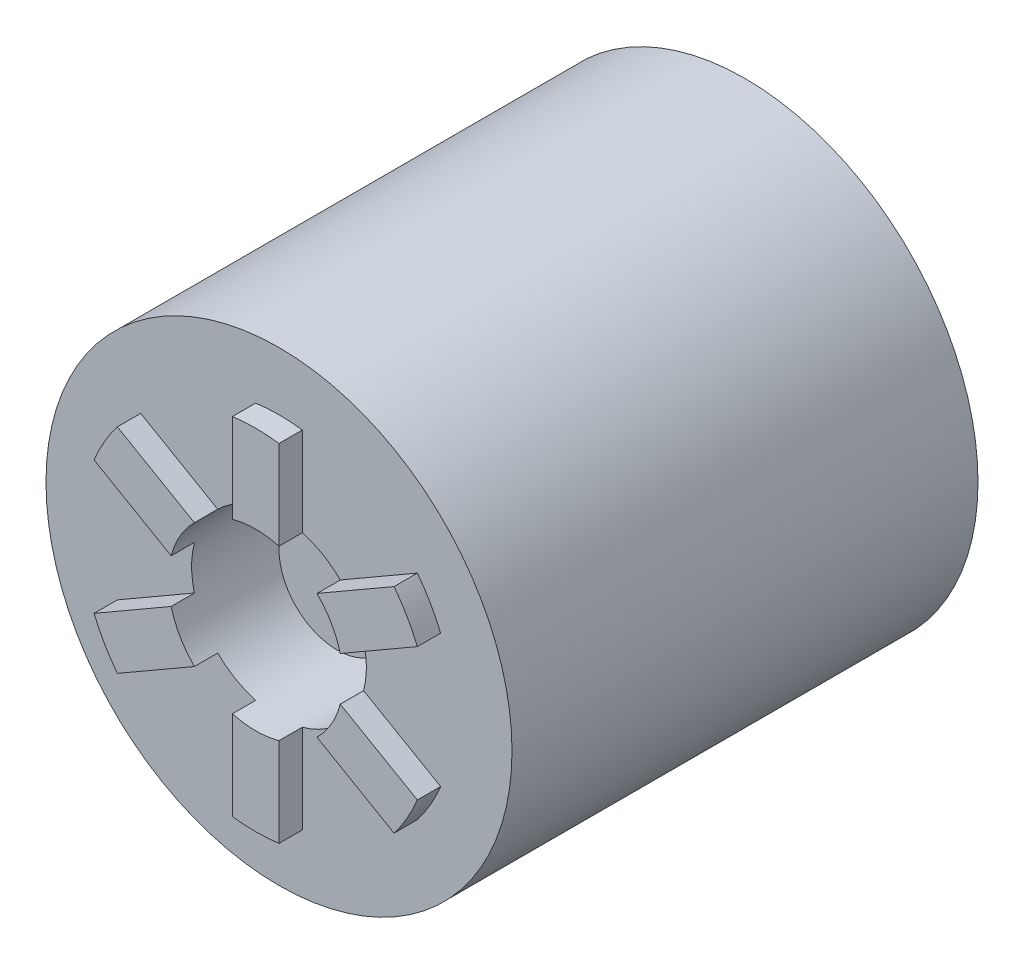
ISO-10303-21;
HEADER;
FILE_DESCRIPTION(('STEP AP214'),'2;1');
FILE_NAME('part.step','',(''),(''),'','','');
FILE_SCHEMA(('AUTOMOTIVE_DESIGN { 1 0 10303 214 1 1 1 1 }'));
ENDSEC;
DATA;
#1=APPLICATION_CONTEXT('core data for automotive mechanical design processes');
#2=APPLICATION_PROTOCOL_DEFINITION('international standard','automotive_design',2000,#1);
#3=PRODUCT_CONTEXT('',#1,'mechanical');
#4=PRODUCT('Part','Part','',(#3));
#5=PRODUCT_RELATED_PRODUCT_CATEGORY('part','',(#4));
#6=PRODUCT_DEFINITION_FORMATION('','',#4);
#7=PRODUCT_DEFINITION_CONTEXT('part definition',#1,'design');
#8=PRODUCT_DEFINITION('design','',#6,#7);
#9=PRODUCT_DEFINITION_SHAPE('','',#8);
#10=(LENGTH_UNIT() NAMED_UNIT(*) SI_UNIT(.MILLI.,.METRE.));
#11=(NAMED_UNIT(*) PLANE_ANGLE_UNIT() SI_UNIT($,.RADIAN.));
#12=(NAMED_UNIT(*) SI_UNIT($,.STERADIAN.) SOLID_ANGLE_UNIT());
#13=UNCERTAINTY_MEASURE_WITH_UNIT(LENGTH_MEASURE(1.E-05),#10,'distance_accuracy_value','');
#14=(GEOMETRIC_REPRESENTATION_CONTEXT(3) GLOBAL_UNCERTAINTY_ASSIGNED_CONTEXT((#13)) GLOBAL_UNIT_ASSIGNED_CONTEXT((#10,
#11,#12)) REPRESENTATION_CONTEXT('',''));
#15=CARTESIAN_POINT('',(0.,0.,0.));
#16=DIRECTION('',(0.,0.,1.));
#17=DIRECTION('',(1.,0.,0.));
#18=AXIS2_PLACEMENT_3D('',#15,#16,#17);
#19=CARTESIAN_POINT('',(0.,0.,40.));
#20=DIRECTION('',(0.,0.,1.));
#21=DIRECTION('',(1.,0.,0.));
#22=AXIS2_PLACEMENT_3D('',#19,#20,#21);
#23=PLANE('',#22);
#24=CARTESIAN_POINT('',(0.,0.,40.));
#25=DIRECTION('',(0.,0.,1.));
#26=DIRECTION('',(1.,0.,0.));
#27=AXIS2_PLACEMENT_3D('',#24,#25,#26);
#28=CIRCLE('',#27,20.);
#29=CARTESIAN_POINT('',(20.,0.,40.));
#30=VERTEX_POINT('',#29);
#31=EDGE_CURVE('E12',#30,#30,#28,.T.);
#32=ORIENTED_EDGE('',*,*,#31,.T.);
#33=EDGE_LOOP('',(#32));
#34=FACE_BOUND('',#33,.T.);
#35=CARTESIAN_POINT('',(0.,0.,40.));
#36=DIRECTION('',(0.,0.,1.));
#37=DIRECTION('',(1.,0.,0.));
#38=AXIS2_PLACEMENT_3D('',#35,#36,#37);
#39=CIRCLE('',#38,15.);
#40=CARTESIAN_POINT('',(-11.8743931895834,9.16508518122775,40.));
#41=VERTEX_POINT('',#40);
#42=CARTESIAN_POINT('',(-13.8743931895834,5.70098356608999,40.));
#43=VERTEX_POINT('',#42);
#44=EDGE_CURVE('E629',#41,#43,#39,.T.);
#45=ORIENTED_EDGE('',*,*,#44,.F.);
#46=DIRECTION('',(-0.866025403784439,0.499999999999999,0.));
#47=VECTOR('',#46,1.);
#48=CARTESIAN_POINT('',(0.99999999999993,1.73205080756876,40.));
#49=LINE('',#48,#47);
#50=CARTESIAN_POINT('',(-5.25999201277456,5.34625888126901,40.));
#51=VERTEX_POINT('',#50);
#52=EDGE_CURVE('E243',#51,#41,#49,.T.);
#53=ORIENTED_EDGE('',*,*,#52,.F.);
#54=CARTESIAN_POINT('',(0.,0.,40.));
#55=DIRECTION('',(0.,0.,1.));
#56=DIRECTION('',(1.,0.,0.));
#57=AXIS2_PLACEMENT_3D('',#54,#55,#56);
#58=CIRCLE('',#57,7.5);
#59=CARTESIAN_POINT('',(-2.,7.22841614740048,40.));
#60=VERTEX_POINT('',#59);
#61=EDGE_CURVE('E455',#60,#51,#58,.T.);
#62=ORIENTED_EDGE('',*,*,#61,.F.);
#63=DIRECTION('',(0.,1.,0.));
#64=VECTOR('',#63,1.);
#65=CARTESIAN_POINT('',(-2.,0.,40.));
#66=LINE('',#65,#64);
#67=CARTESIAN_POINT('',(-2.,14.8660687473185,40.));
#68=VERTEX_POINT('',#67);
#69=EDGE_CURVE('E415',#60,#68,#66,.T.);
#70=ORIENTED_EDGE('',*,*,#69,.T.);
#71=CARTESIAN_POINT('',(0.,0.,40.));
#72=DIRECTION('',(0.,0.,1.));
#73=DIRECTION('',(1.,0.,0.));
#74=AXIS2_PLACEMENT_3D('',#71,#72,#73);
#75=CIRCLE('',#74,15.);
#76=CARTESIAN_POINT('',(2.,14.8660687473185,40.));
#77=VERTEX_POINT('',#76);
#78=EDGE_CURVE('E429',#77,#68,#75,.T.);
#79=ORIENTED_EDGE('',*,*,#78,.F.);
#80=DIRECTION('',(0.,1.,0.));
#81=VECTOR('',#80,1.);
#82=CARTESIAN_POINT('',(2.,0.,40.));
#83=LINE('',#82,#81);
#84=CARTESIAN_POINT('',(2.,7.22841614740048,40.));
#85=VERTEX_POINT('',#84);
#86=EDGE_CURVE('E409',#85,#77,#83,.T.);
#87=ORIENTED_EDGE('',*,*,#86,.F.);
#88=CARTESIAN_POINT('',(5.25999201277418,5.34625888126939,40.));
#89=VERTEX_POINT('',#88);
#90=EDGE_CURVE('E450',#89,#85,#58,.T.);
#91=ORIENTED_EDGE('',*,*,#90,.F.);
#92=DIRECTION('',(0.866025403784439,0.5,0.));
#93=VECTOR('',#92,1.);
#94=CARTESIAN_POINT('',(-1.00000000000019,1.7320508075692,40.));
#95=LINE('',#94,#93);
#96=CARTESIAN_POINT('',(11.8743931895839,9.16508518122864,40.));
#97=VERTEX_POINT('',#96);
#98=EDGE_CURVE('E375',#89,#97,#95,.T.);
#99=ORIENTED_EDGE('',*,*,#98,.T.);
#100=CARTESIAN_POINT('',(0.,0.,40.));
#101=DIRECTION('',(0.,0.,1.));
#102=DIRECTION('',(1.,0.,0.));
#103=AXIS2_PLACEMENT_3D('',#100,#101,#102);
#104=CIRCLE('',#103,15.);
#105=CARTESIAN_POINT('',(13.8743931895839,5.70098356609089,40.));
#106=VERTEX_POINT('',#105);
#107=EDGE_CURVE('E389',#106,#97,#104,.T.);
#108=ORIENTED_EDGE('',*,*,#107,.F.);
#109=DIRECTION('',(0.866025403784439,0.5,0.));
#110=VECTOR('',#109,1.);
#111=CARTESIAN_POINT('',(0.999999999999812,-1.73205080756855,40.));
#112=LINE('',#111,#110);
#113=CARTESIAN_POINT('',(7.25999201277436,1.88215726613174,40.));
#114=VERTEX_POINT('',#113);
#115=EDGE_CURVE('E369',#114,#106,#112,.T.);
#116=ORIENTED_EDGE('',*,*,#115,.F.);
#117=CARTESIAN_POINT('',(7.25999201277469,-1.88215726613047,40.));
#118=VERTEX_POINT('',#117);
#119=EDGE_CURVE('E648',#118,#114,#58,.T.);
#120=ORIENTED_EDGE('',*,*,#119,.F.);
#121=DIRECTION('',(0.866025403784439,-0.5,0.));
#122=VECTOR('',#121,1.);
#123=CARTESIAN_POINT('',(1.00000000000044,1.73205080756965,40.));
#124=LINE('',#123,#122);
#125=CARTESIAN_POINT('',(13.8743931895844,-5.70098356608972,40.));
#126=VERTEX_POINT('',#125);
#127=EDGE_CURVE('E335',#118,#126,#124,.T.);
#128=ORIENTED_EDGE('',*,*,#127,.T.);
#129=CARTESIAN_POINT('',(0.,0.,40.));
#130=DIRECTION('',(0.,0.,1.));
#131=DIRECTION('',(1.,0.,0.));
#132=AXIS2_PLACEMENT_3D('',#129,#130,#131);
#133=CIRCLE('',#132,15.);
#134=CARTESIAN_POINT('',(11.8743931895844,-9.16508518122748,40.));
#135=VERTEX_POINT('',#134);
#136=EDGE_CURVE('E349',#135,#126,#133,.T.);
#137=ORIENTED_EDGE('',*,*,#136,.F.);
#138=DIRECTION('',(0.866025403784439,-0.5,0.));
#139=VECTOR('',#138,1.);
#140=CARTESIAN_POINT('',(-0.999999999999556,-1.73205080756811,40.));
#141=LINE('',#140,#139);
#142=CARTESIAN_POINT('',(5.25999201277511,-5.34625888126847,40.));
#143=VERTEX_POINT('',#142);
#144=EDGE_CURVE('E329',#143,#135,#141,.T.);
#145=ORIENTED_EDGE('',*,*,#144,.F.);
#146=CARTESIAN_POINT('',(2.00000000000103,-7.2284161474002,40.));
#147=VERTEX_POINT('',#146);
#148=EDGE_CURVE('E644',#147,#143,#58,.T.);
#149=ORIENTED_EDGE('',*,*,#148,.F.);
#150=DIRECTION('',(0.,-1.,0.));
#151=VECTOR('',#150,1.);
#152=CARTESIAN_POINT('',(2.00000000000103,0.,40.));
#153=LINE('',#152,#151);
#154=CARTESIAN_POINT('',(2.00000000000103,-14.8660687473182,40.));
#155=VERTEX_POINT('',#154);
#156=EDGE_CURVE('E295',#147,#155,#153,.T.);
#157=ORIENTED_EDGE('',*,*,#156,.T.);
#158=CARTESIAN_POINT('',(0.,0.,40.));
#159=DIRECTION('',(0.,0.,1.));
#160=DIRECTION('',(1.,0.,0.));
#161=AXIS2_PLACEMENT_3D('',#158,#159,#160);
#162=CIRCLE('',#161,15.);
#163=CARTESIAN_POINT('',(-1.99999999999897,-14.8660687473182,40.));
#164=VERTEX_POINT('',#163);
#165=EDGE_CURVE('E309',#164,#155,#162,.T.);
#166=ORIENTED_EDGE('',*,*,#165,.F.);
#167=DIRECTION('',(0.,-1.,0.));
#168=VECTOR('',#167,1.);
#169=CARTESIAN_POINT('',(-1.99999999999897,0.,40.));
#170=LINE('',#169,#168);
#171=CARTESIAN_POINT('',(-1.99999999999897,-7.22841614740076,40.));
#172=VERTEX_POINT('',#171);
#173=EDGE_CURVE('E289',#172,#164,#170,.T.);
#174=ORIENTED_EDGE('',*,*,#173,.F.);
#175=CARTESIAN_POINT('',(-5.25999201277397,-5.34625888126959,40.));
#176=VERTEX_POINT('',#175);
#177=EDGE_CURVE('E642',#176,#172,#58,.T.);
#178=ORIENTED_EDGE('',*,*,#177,.F.);
#179=DIRECTION('',(-0.866025403784438,-0.5,0.));
#180=VECTOR('',#179,1.);
#181=CARTESIAN_POINT('',(1.00000000000033,-1.73205080756944,40.));
#182=LINE('',#181,#180);
#183=CARTESIAN_POINT('',(-11.8743931895828,-9.16508518122837,40.));
#184=VERTEX_POINT('',#183);
#185=EDGE_CURVE('E81',#176,#184,#182,.T.);
#186=ORIENTED_EDGE('',*,*,#185,.T.);
#187=CARTESIAN_POINT('',(0.,0.,40.));
#188=DIRECTION('',(0.,0.,1.));
#189=DIRECTION('',(1.,0.,0.));
#190=AXIS2_PLACEMENT_3D('',#187,#188,#189);
#191=CIRCLE('',#190,15.);
#192=CARTESIAN_POINT('',(-13.8743931895828,-5.70098356609062,40.));
#193=VERTEX_POINT('',#192);
#194=EDGE_CURVE('E251',#193,#184,#191,.T.);
#195=ORIENTED_EDGE('',*,*,#194,.F.);
#196=DIRECTION('',(-0.866025403784438,-0.5,0.));
#197=VECTOR('',#196,1.);
#198=CARTESIAN_POINT('',(-0.999999999999676,1.73205080756831,40.));
#199=LINE('',#198,#197);
#200=CARTESIAN_POINT('',(-7.25999201277429,-1.88215726613202,40.));
#201=VERTEX_POINT('',#200);
#202=EDGE_CURVE('E246',#201,#193,#199,.T.);
#203=ORIENTED_EDGE('',*,*,#202,.F.);
#204=CARTESIAN_POINT('',(-7.25999201277449,1.88215726613122,40.));
#205=VERTEX_POINT('',#204);
#206=EDGE_CURVE('E458',#205,#201,#58,.T.);
#207=ORIENTED_EDGE('',*,*,#206,.F.);
#208=DIRECTION('',(-0.866025403784439,0.499999999999999,0.));
#209=VECTOR('',#208,1.);
#210=CARTESIAN_POINT('',(-1.00000000000007,-1.732050807569,40.));
#211=LINE('',#210,#209);
#212=EDGE_CURVE('E73',#205,#43,#211,.T.);
#213=ORIENTED_EDGE('',*,*,#212,.T.);
#214=EDGE_LOOP('',(#45,#53,#62,#70,#79,#87,#91,#99,#108,#116,#120,#128,#137,#145,#149,#157,#166,
#174,#178,#186,#195,#203,#207,#213));
#215=FACE_BOUND('',#214,.T.);
#216=ADVANCED_FACE('F55',(#34,#215),#23,.T.);
#217=CARTESIAN_POINT('',(0.,0.,40.));
#218=DIRECTION('',(0.,0.,-1.));
#219=DIRECTION('',(-1.,0.,0.));
#220=AXIS2_PLACEMENT_3D('',#217,#218,#219);
#221=CYLINDRICAL_SURFACE('',#220,20.);
#222=ORIENTED_EDGE('',*,*,#31,.F.);
#223=EDGE_LOOP('',(#222));
#224=FACE_BOUND('',#223,.T.);
#225=CARTESIAN_POINT('',(0.,0.,0.));
#226=DIRECTION('',(0.,0.,1.));
#227=DIRECTION('',(1.,0.,0.));
#228=AXIS2_PLACEMENT_3D('',#225,#226,#227);
#229=CIRCLE('',#228,20.);
#230=CARTESIAN_POINT('',(20.,0.,0.));
#231=VERTEX_POINT('',#230);
#232=EDGE_CURVE('E65',#231,#231,#229,.T.);
#233=ORIENTED_EDGE('',*,*,#232,.T.);
#234=EDGE_LOOP('',(#233));
#235=FACE_BOUND('',#234,.T.);
#236=ADVANCED_FACE('F57',(#224,#235),#221,.T.);
#237=CARTESIAN_POINT('',(0.,0.,0.));
#238=DIRECTION('',(0.,0.,1.));
#239=DIRECTION('',(1.,0.,0.));
#240=AXIS2_PLACEMENT_3D('',#237,#238,#239);
#241=PLANE('',#240);
#242=CARTESIAN_POINT('',(0.,0.,0.));
#243=DIRECTION('',(0.,0.,-1.));
#244=DIRECTION('',(-1.,0.,0.));
#245=AXIS2_PLACEMENT_3D('',#242,#243,#244);
#246=CIRCLE('',#245,12.5);
#247=CARTESIAN_POINT('',(-12.5,0.,0.));
#248=VERTEX_POINT('',#247);
#249=EDGE_CURVE('E604',#248,#248,#246,.T.);
#250=ORIENTED_EDGE('',*,*,#249,.F.);
#251=EDGE_LOOP('',(#250));
#252=FACE_BOUND('',#251,.T.);
#253=ORIENTED_EDGE('',*,*,#232,.F.);
#254=EDGE_LOOP('',(#253));
#255=FACE_BOUND('',#254,.T.);
#256=ADVANCED_FACE('F464',(#252,#255),#241,.F.);
#257=CARTESIAN_POINT('',(0.,0.,30.));
#258=DIRECTION('',(0.,0.,1.));
#259=DIRECTION('',(1.,0.,0.));
#260=AXIS2_PLACEMENT_3D('',#257,#258,#259);
#261=CYLINDRICAL_SURFACE('',#260,7.5);
#262=CARTESIAN_POINT('',(0.,0.,30.));
#263=DIRECTION('',(0.,0.,1.));
#264=DIRECTION('',(1.,0.,0.));
#265=AXIS2_PLACEMENT_3D('',#262,#263,#264);
#266=CIRCLE('',#265,7.5);
#267=CARTESIAN_POINT('',(7.5,0.,30.));
#268=VERTEX_POINT('',#267);
#269=EDGE_CURVE('E451',#268,#268,#266,.T.);
#270=ORIENTED_EDGE('',*,*,#269,.F.);
#271=EDGE_LOOP('',(#270));
#272=FACE_BOUND('',#271,.T.);
#273=ORIENTED_EDGE('',*,*,#61,.T.);
#274=DIRECTION('',(0.,0.,-1.));
#275=VECTOR('',#274,1.);
#276=CARTESIAN_POINT('',(-5.25999201277456,5.34625888126901,42.));
#277=LINE('',#276,#275);
#278=CARTESIAN_POINT('',(-5.25999201277456,5.34625888126901,42.));
#279=VERTEX_POINT('',#278);
#280=EDGE_CURVE('E626',#279,#51,#277,.T.);
#281=ORIENTED_EDGE('',*,*,#280,.F.);
#282=CARTESIAN_POINT('',(0.,0.,42.));
#283=DIRECTION('',(0.,0.,1.));
#284=DIRECTION('',(1.,0.,0.));
#285=AXIS2_PLACEMENT_3D('',#282,#283,#284);
#286=CIRCLE('',#285,7.5);
#287=CARTESIAN_POINT('',(-7.25999201277449,1.88215726613122,42.));
#288=VERTEX_POINT('',#287);
#289=EDGE_CURVE('E236',#288,#279,#286,.F.);
#290=ORIENTED_EDGE('',*,*,#289,.F.);
#291=DIRECTION('',(0.,0.,-1.));
#292=VECTOR('',#291,1.);
#293=CARTESIAN_POINT('',(-7.25999201277449,1.88215726613122,42.));
#294=LINE('',#293,#292);
#295=EDGE_CURVE('E253',#288,#205,#294,.T.);
#296=ORIENTED_EDGE('',*,*,#295,.T.);
#297=ORIENTED_EDGE('',*,*,#206,.T.);
#298=DIRECTION('',(0.,0.,-1.));
#299=VECTOR('',#298,1.);
#300=CARTESIAN_POINT('',(-7.25999201277429,-1.88215726613202,42.));
#301=LINE('',#300,#299);
#302=CARTESIAN_POINT('',(-7.25999201277429,-1.88215726613202,42.));
#303=VERTEX_POINT('',#302);
#304=EDGE_CURVE('E270',#303,#201,#301,.T.);
#305=ORIENTED_EDGE('',*,*,#304,.F.);
#306=CARTESIAN_POINT('',(0.,0.,42.));
#307=DIRECTION('',(0.,0.,1.));
#308=DIRECTION('',(1.,0.,0.));
#309=AXIS2_PLACEMENT_3D('',#306,#307,#308);
#310=CIRCLE('',#309,7.5);
#311=CARTESIAN_POINT('',(-5.25999201277397,-5.34625888126959,42.));
#312=VERTEX_POINT('',#311);
#313=EDGE_CURVE('E268',#312,#303,#310,.F.);
#314=ORIENTED_EDGE('',*,*,#313,.F.);
#315=DIRECTION('',(0.,0.,-1.));
#316=VECTOR('',#315,1.);
#317=CARTESIAN_POINT('',(-5.25999201277397,-5.34625888126959,42.));
#318=LINE('',#317,#316);
#319=EDGE_CURVE('E280',#312,#176,#318,.T.);
#320=ORIENTED_EDGE('',*,*,#319,.T.);
#321=ORIENTED_EDGE('',*,*,#177,.T.);
#322=DIRECTION('',(0.,0.,-1.));
#323=VECTOR('',#322,1.);
#324=CARTESIAN_POINT('',(-1.99999999999897,-7.22841614740076,42.));
#325=LINE('',#324,#323);
#326=CARTESIAN_POINT('',(-1.99999999999897,-7.22841614740076,42.));
#327=VERTEX_POINT('',#326);
#328=EDGE_CURVE('E305',#327,#172,#325,.T.);
#329=ORIENTED_EDGE('',*,*,#328,.F.);
#330=CARTESIAN_POINT('',(0.,0.,42.));
#331=DIRECTION('',(0.,0.,1.));
#332=DIRECTION('',(1.,0.,0.));
#333=AXIS2_PLACEMENT_3D('',#330,#331,#332);
#334=CIRCLE('',#333,7.5);
#335=CARTESIAN_POINT('',(2.00000000000103,-7.2284161474002,42.));
#336=VERTEX_POINT('',#335);
#337=EDGE_CURVE('E302',#336,#327,#334,.F.);
#338=ORIENTED_EDGE('',*,*,#337,.F.);
#339=DIRECTION('',(0.,0.,-1.));
#340=VECTOR('',#339,1.);
#341=CARTESIAN_POINT('',(2.00000000000103,-7.2284161474002,42.));
#342=LINE('',#341,#340);
#343=EDGE_CURVE('E319',#336,#147,#342,.T.);
#344=ORIENTED_EDGE('',*,*,#343,.T.);
#345=ORIENTED_EDGE('',*,*,#148,.T.);
#346=DIRECTION('',(0.,0.,-1.));
#347=VECTOR('',#346,1.);
#348=CARTESIAN_POINT('',(5.25999201277511,-5.34625888126847,42.));
#349=LINE('',#348,#347);
#350=CARTESIAN_POINT('',(5.25999201277511,-5.34625888126847,42.));
#351=VERTEX_POINT('',#350);
#352=EDGE_CURVE('E345',#351,#143,#349,.T.);
#353=ORIENTED_EDGE('',*,*,#352,.F.);
#354=CARTESIAN_POINT('',(0.,0.,42.));
#355=DIRECTION('',(0.,0.,1.));
#356=DIRECTION('',(1.,0.,0.));
#357=AXIS2_PLACEMENT_3D('',#354,#355,#356);
#358=CIRCLE('',#357,7.5);
#359=CARTESIAN_POINT('',(7.25999201277469,-1.88215726613047,42.));
#360=VERTEX_POINT('',#359);
#361=EDGE_CURVE('E342',#360,#351,#358,.F.);
#362=ORIENTED_EDGE('',*,*,#361,.F.);
#363=DIRECTION('',(0.,0.,-1.));
#364=VECTOR('',#363,1.);
#365=CARTESIAN_POINT('',(7.25999201277469,-1.88215726613047,42.));
#366=LINE('',#365,#364);
#367=EDGE_CURVE('E359',#360,#118,#366,.T.);
#368=ORIENTED_EDGE('',*,*,#367,.T.);
#369=ORIENTED_EDGE('',*,*,#119,.T.);
#370=DIRECTION('',(0.,0.,-1.));
#371=VECTOR('',#370,1.);
#372=CARTESIAN_POINT('',(7.25999201277436,1.88215726613174,42.));
#373=LINE('',#372,#371);
#374=CARTESIAN_POINT('',(7.25999201277436,1.88215726613174,42.));
#375=VERTEX_POINT('',#374);
#376=EDGE_CURVE('E385',#375,#114,#373,.T.);
#377=ORIENTED_EDGE('',*,*,#376,.F.);
#378=CARTESIAN_POINT('',(0.,0.,42.));
#379=DIRECTION('',(0.,0.,1.));
#380=DIRECTION('',(1.,0.,0.));
#381=AXIS2_PLACEMENT_3D('',#378,#379,#380);
#382=CIRCLE('',#381,7.5);
#383=CARTESIAN_POINT('',(5.25999201277418,5.34625888126939,42.));
#384=VERTEX_POINT('',#383);
#385=EDGE_CURVE('E382',#384,#375,#382,.F.);
#386=ORIENTED_EDGE('',*,*,#385,.F.);
#387=DIRECTION('',(0.,0.,-1.));
#388=VECTOR('',#387,1.);
#389=CARTESIAN_POINT('',(5.25999201277418,5.34625888126939,42.));
#390=LINE('',#389,#388);
#391=EDGE_CURVE('E399',#384,#89,#390,.T.);
#392=ORIENTED_EDGE('',*,*,#391,.T.);
#393=ORIENTED_EDGE('',*,*,#90,.T.);
#394=DIRECTION('',(0.,0.,-1.));
#395=VECTOR('',#394,1.);
#396=CARTESIAN_POINT('',(2.,7.22841614740048,42.));
#397=LINE('',#396,#395);
#398=CARTESIAN_POINT('',(2.,7.22841614740048,42.));
#399=VERTEX_POINT('',#398);
#400=EDGE_CURVE('E425',#399,#85,#397,.T.);
#401=ORIENTED_EDGE('',*,*,#400,.F.);
#402=CARTESIAN_POINT('',(0.,0.,42.));
#403=DIRECTION('',(0.,0.,1.));
#404=DIRECTION('',(1.,0.,0.));
#405=AXIS2_PLACEMENT_3D('',#402,#403,#404);
#406=CIRCLE('',#405,7.5);
#407=CARTESIAN_POINT('',(-2.,7.22841614740048,42.));
#408=VERTEX_POINT('',#407);
#409=EDGE_CURVE('E422',#408,#399,#406,.F.);
#410=ORIENTED_EDGE('',*,*,#409,.F.);
#411=DIRECTION('',(0.,0.,-1.));
#412=VECTOR('',#411,1.);
#413=CARTESIAN_POINT('',(-2.,7.22841614740048,42.));
#414=LINE('',#413,#412);
#415=EDGE_CURVE('E438',#408,#60,#414,.T.);
#416=ORIENTED_EDGE('',*,*,#415,.T.);
#417=EDGE_LOOP('',(#273,#281,#290,#296,#297,#305,#314,#320,#321,#329,#338,#344,#345,#353,#362,
#368,#369,#377,#386,#392,#393,#401,#410,#416));
#418=FACE_BOUND('',#417,.T.);
#419=ADVANCED_FACE('F466',(#272,#418),#261,.F.);
#420=CARTESIAN_POINT('',(0.,0.,30.));
#421=DIRECTION('',(0.,0.,1.));
#422=DIRECTION('',(1.,0.,0.));
#423=AXIS2_PLACEMENT_3D('',#420,#421,#422);
#424=PLANE('',#423);
#425=CARTESIAN_POINT('',(0.,0.,30.));
#426=DIRECTION('',(0.,0.,1.));
#427=DIRECTION('',(1.,0.,0.));
#428=AXIS2_PLACEMENT_3D('',#425,#426,#427);
#429=CIRCLE('',#428,5.);
#430=CARTESIAN_POINT('',(5.,0.,30.));
#431=VERTEX_POINT('',#430);
#432=EDGE_CURVE('E605',#431,#431,#429,.T.);
#433=ORIENTED_EDGE('',*,*,#432,.F.);
#434=EDGE_LOOP('',(#433));
#435=FACE_BOUND('',#434,.T.);
#436=ORIENTED_EDGE('',*,*,#269,.T.);
#437=EDGE_LOOP('',(#436));
#438=FACE_BOUND('',#437,.T.);
#439=ADVANCED_FACE('F472',(#435,#438),#424,.T.);
#440=CARTESIAN_POINT('',(2.,0.,42.));
#441=DIRECTION('',(-1.,0.,0.));
#442=DIRECTION('',(0.,0.,1.));
#443=AXIS2_PLACEMENT_3D('',#440,#441,#442);
#444=PLANE('',#443);
#445=ORIENTED_EDGE('',*,*,#86,.T.);
#446=DIRECTION('',(0.,0.,-1.));
#447=VECTOR('',#446,1.);
#448=CARTESIAN_POINT('',(2.,14.8660687473185,42.));
#449=LINE('',#448,#447);
#450=CARTESIAN_POINT('',(2.,14.8660687473185,42.));
#451=VERTEX_POINT('',#450);
#452=EDGE_CURVE('E446',#451,#77,#449,.T.);
#453=ORIENTED_EDGE('',*,*,#452,.F.);
#454=DIRECTION('',(0.,1.,0.));
#455=VECTOR('',#454,1.);
#456=CARTESIAN_POINT('',(2.,0.,42.));
#457=LINE('',#456,#455);
#458=EDGE_CURVE('E410',#399,#451,#457,.T.);
#459=ORIENTED_EDGE('',*,*,#458,.F.);
#460=ORIENTED_EDGE('',*,*,#400,.T.);
#461=EDGE_LOOP('',(#445,#453,#459,#460));
#462=FACE_BOUND('',#461,.T.);
#463=ADVANCED_FACE('F486',(#462),#444,.F.);
#464=CARTESIAN_POINT('',(0.,0.,42.));
#465=DIRECTION('',(0.,0.,-1.));
#466=DIRECTION('',(-1.,0.,0.));
#467=AXIS2_PLACEMENT_3D('',#464,#465,#466);
#468=CYLINDRICAL_SURFACE('',#467,15.);
#469=ORIENTED_EDGE('',*,*,#78,.T.);
#470=DIRECTION('',(0.,0.,-1.));
#471=VECTOR('',#470,1.);
#472=CARTESIAN_POINT('',(-2.,14.8660687473185,42.));
#473=LINE('',#472,#471);
#474=CARTESIAN_POINT('',(-2.,14.8660687473185,42.));
#475=VERTEX_POINT('',#474);
#476=EDGE_CURVE('E442',#475,#68,#473,.T.);
#477=ORIENTED_EDGE('',*,*,#476,.F.);
#478=CARTESIAN_POINT('',(0.,0.,42.));
#479=DIRECTION('',(0.,0.,1.));
#480=DIRECTION('',(1.,0.,0.));
#481=AXIS2_PLACEMENT_3D('',#478,#479,#480);
#482=CIRCLE('',#481,15.);
#483=EDGE_CURVE('E414',#451,#475,#482,.T.);
#484=ORIENTED_EDGE('',*,*,#483,.F.);
#485=ORIENTED_EDGE('',*,*,#452,.T.);
#486=EDGE_LOOP('',(#469,#477,#484,#485));
#487=FACE_BOUND('',#486,.T.);
#488=ADVANCED_FACE('F490',(#487),#468,.T.);
#489=CARTESIAN_POINT('',(-2.,0.,42.));
#490=DIRECTION('',(-1.,0.,0.));
#491=DIRECTION('',(0.,0.,1.));
#492=AXIS2_PLACEMENT_3D('',#489,#490,#491);
#493=PLANE('',#492);
#494=ORIENTED_EDGE('',*,*,#69,.F.);
#495=ORIENTED_EDGE('',*,*,#415,.F.);
#496=DIRECTION('',(0.,1.,0.));
#497=VECTOR('',#496,1.);
#498=CARTESIAN_POINT('',(-2.,0.,42.));
#499=LINE('',#498,#497);
#500=EDGE_CURVE('E418',#408,#475,#499,.T.);
#501=ORIENTED_EDGE('',*,*,#500,.T.);
#502=ORIENTED_EDGE('',*,*,#476,.T.);
#503=EDGE_LOOP('',(#494,#495,#501,#502));
#504=FACE_BOUND('',#503,.T.);
#505=ADVANCED_FACE('F494',(#504),#493,.T.);
#506=CARTESIAN_POINT('',(0.,0.,42.));
#507=DIRECTION('',(0.,0.,1.));
#508=DIRECTION('',(1.,0.,0.));
#509=AXIS2_PLACEMENT_3D('',#506,#507,#508);
#510=PLANE('',#509);
#511=ORIENTED_EDGE('',*,*,#458,.T.);
#512=ORIENTED_EDGE('',*,*,#483,.T.);
#513=ORIENTED_EDGE('',*,*,#500,.F.);
#514=ORIENTED_EDGE('',*,*,#409,.T.);
#515=EDGE_LOOP('',(#511,#512,#513,#514));
#516=FACE_BOUND('',#515,.T.);
#517=ADVANCED_FACE('F498',(#516),#510,.T.);
#518=CARTESIAN_POINT('',(0.999999999999812,-1.73205080756855,42.));
#519=DIRECTION('',(-0.5,0.866025403784439,0.));
#520=DIRECTION('',(-0.866025403784439,-0.5,0.));
#521=AXIS2_PLACEMENT_3D('',#518,#519,#520);
#522=PLANE('',#521);
#523=ORIENTED_EDGE('',*,*,#115,.T.);
#524=DIRECTION('',(0.,0.,-1.));
#525=VECTOR('',#524,1.);
#526=CARTESIAN_POINT('',(13.8743931895839,5.70098356609089,42.));
#527=LINE('',#526,#525);
#528=CARTESIAN_POINT('',(13.8743931895839,5.70098356609089,42.));
#529=VERTEX_POINT('',#528);
#530=EDGE_CURVE('E406',#529,#106,#527,.T.);
#531=ORIENTED_EDGE('',*,*,#530,.F.);
#532=DIRECTION('',(0.866025403784439,0.5,0.));
#533=VECTOR('',#532,1.);
#534=CARTESIAN_POINT('',(0.999999999999812,-1.73205080756855,42.));
#535=LINE('',#534,#533);
#536=EDGE_CURVE('E370',#375,#529,#535,.T.);
#537=ORIENTED_EDGE('',*,*,#536,.F.);
#538=ORIENTED_EDGE('',*,*,#376,.T.);
#539=EDGE_LOOP('',(#523,#531,#537,#538));
#540=FACE_BOUND('',#539,.T.);
#541=ADVANCED_FACE('F502',(#540),#522,.F.);
#542=CARTESIAN_POINT('',(0.,0.,42.));
#543=DIRECTION('',(0.,0.,-1.));
#544=DIRECTION('',(-1.,0.,0.));
#545=AXIS2_PLACEMENT_3D('',#542,#543,#544);
#546=CYLINDRICAL_SURFACE('',#545,15.);
#547=ORIENTED_EDGE('',*,*,#107,.T.);
#548=DIRECTION('',(0.,0.,-1.));
#549=VECTOR('',#548,1.);
#550=CARTESIAN_POINT('',(11.8743931895839,9.16508518122864,42.));
#551=LINE('',#550,#549);
#552=CARTESIAN_POINT('',(11.8743931895839,9.16508518122864,42.));
#553=VERTEX_POINT('',#552);
#554=EDGE_CURVE('E403',#553,#97,#551,.T.);
#555=ORIENTED_EDGE('',*,*,#554,.F.);
#556=CARTESIAN_POINT('',(0.,0.,42.));
#557=DIRECTION('',(0.,0.,1.));
#558=DIRECTION('',(1.,0.,0.));
#559=AXIS2_PLACEMENT_3D('',#556,#557,#558);
#560=CIRCLE('',#559,15.);
#561=EDGE_CURVE('E374',#529,#553,#560,.T.);
#562=ORIENTED_EDGE('',*,*,#561,.F.);
#563=ORIENTED_EDGE('',*,*,#530,.T.);
#564=EDGE_LOOP('',(#547,#555,#562,#563));
#565=FACE_BOUND('',#564,.T.);
#566=ADVANCED_FACE('F506',(#565),#546,.T.);
#567=CARTESIAN_POINT('',(-1.00000000000019,1.7320508075692,42.));
#568=DIRECTION('',(-0.5,0.866025403784439,0.));
#569=DIRECTION('',(-0.866025403784439,-0.5,0.));
#570=AXIS2_PLACEMENT_3D('',#567,#568,#569);
#571=PLANE('',#570);
#572=ORIENTED_EDGE('',*,*,#98,.F.);
#573=ORIENTED_EDGE('',*,*,#391,.F.);
#574=DIRECTION('',(0.866025403784439,0.5,0.));
#575=VECTOR('',#574,1.);
#576=CARTESIAN_POINT('',(-1.00000000000019,1.7320508075692,42.));
#577=LINE('',#576,#575);
#578=EDGE_CURVE('E378',#384,#553,#577,.T.);
#579=ORIENTED_EDGE('',*,*,#578,.T.);
#580=ORIENTED_EDGE('',*,*,#554,.T.);
#581=EDGE_LOOP('',(#572,#573,#579,#580));
#582=FACE_BOUND('',#581,.T.);
#583=ADVANCED_FACE('F510',(#582),#571,.T.);
#584=CARTESIAN_POINT('',(0.,0.,42.));
#585=DIRECTION('',(0.,0.,1.));
#586=DIRECTION('',(1.,0.,0.));
#587=AXIS2_PLACEMENT_3D('',#584,#585,#586);
#588=PLANE('',#587);
#589=ORIENTED_EDGE('',*,*,#536,.T.);
#590=ORIENTED_EDGE('',*,*,#561,.T.);
#591=ORIENTED_EDGE('',*,*,#578,.F.);
#592=ORIENTED_EDGE('',*,*,#385,.T.);
#593=EDGE_LOOP('',(#589,#590,#591,#592));
#594=FACE_BOUND('',#593,.T.);
#595=ADVANCED_FACE('F514',(#594),#588,.T.);
#596=CARTESIAN_POINT('',(-0.999999999999556,-1.73205080756811,42.));
#597=DIRECTION('',(0.5,0.866025403784439,0.));
#598=DIRECTION('',(-0.866025403784439,0.5,0.));
#599=AXIS2_PLACEMENT_3D('',#596,#597,#598);
#600=PLANE('',#599);
#601=ORIENTED_EDGE('',*,*,#144,.T.);
#602=DIRECTION('',(0.,0.,-1.));
#603=VECTOR('',#602,1.);
#604=CARTESIAN_POINT('',(11.8743931895844,-9.16508518122748,42.));
#605=LINE('',#604,#603);
#606=CARTESIAN_POINT('',(11.8743931895844,-9.16508518122748,42.));
#607=VERTEX_POINT('',#606);
#608=EDGE_CURVE('E366',#607,#135,#605,.T.);
#609=ORIENTED_EDGE('',*,*,#608,.F.);
#610=DIRECTION('',(0.866025403784439,-0.5,0.));
#611=VECTOR('',#610,1.);
#612=CARTESIAN_POINT('',(-0.999999999999556,-1.73205080756811,42.));
#613=LINE('',#612,#611);
#614=EDGE_CURVE('E330',#351,#607,#613,.T.);
#615=ORIENTED_EDGE('',*,*,#614,.F.);
#616=ORIENTED_EDGE('',*,*,#352,.T.);
#617=EDGE_LOOP('',(#601,#609,#615,#616));
#618=FACE_BOUND('',#617,.T.);
#619=ADVANCED_FACE('F518',(#618),#600,.F.);
#620=CARTESIAN_POINT('',(0.,0.,42.));
#621=DIRECTION('',(0.,0.,-1.));
#622=DIRECTION('',(-1.,0.,0.));
#623=AXIS2_PLACEMENT_3D('',#620,#621,#622);
#624=CYLINDRICAL_SURFACE('',#623,15.);
#625=ORIENTED_EDGE('',*,*,#136,.T.);
#626=DIRECTION('',(0.,0.,-1.));
#627=VECTOR('',#626,1.);
#628=CARTESIAN_POINT('',(13.8743931895844,-5.70098356608972,42.));
#629=LINE('',#628,#627);
#630=CARTESIAN_POINT('',(13.8743931895844,-5.70098356608972,42.));
#631=VERTEX_POINT('',#630);
#632=EDGE_CURVE('E363',#631,#126,#629,.T.);
#633=ORIENTED_EDGE('',*,*,#632,.F.);
#634=CARTESIAN_POINT('',(0.,0.,42.));
#635=DIRECTION('',(0.,0.,1.));
#636=DIRECTION('',(1.,0.,0.));
#637=AXIS2_PLACEMENT_3D('',#634,#635,#636);
#638=CIRCLE('',#637,15.);
#639=EDGE_CURVE('E334',#607,#631,#638,.T.);
#640=ORIENTED_EDGE('',*,*,#639,.F.);
#641=ORIENTED_EDGE('',*,*,#608,.T.);
#642=EDGE_LOOP('',(#625,#633,#640,#641));
#643=FACE_BOUND('',#642,.T.);
#644=ADVANCED_FACE('F522',(#643),#624,.T.);
#645=CARTESIAN_POINT('',(1.00000000000044,1.73205080756965,42.));
#646=DIRECTION('',(0.5,0.866025403784439,0.));
#647=DIRECTION('',(-0.866025403784439,0.5,0.));
#648=AXIS2_PLACEMENT_3D('',#645,#646,#647);
#649=PLANE('',#648);
#650=ORIENTED_EDGE('',*,*,#127,.F.);
#651=ORIENTED_EDGE('',*,*,#367,.F.);
#652=DIRECTION('',(0.866025403784439,-0.5,0.));
#653=VECTOR('',#652,1.);
#654=CARTESIAN_POINT('',(1.00000000000044,1.73205080756965,42.));
#655=LINE('',#654,#653);
#656=EDGE_CURVE('E338',#360,#631,#655,.T.);
#657=ORIENTED_EDGE('',*,*,#656,.T.);
#658=ORIENTED_EDGE('',*,*,#632,.T.);
#659=EDGE_LOOP('',(#650,#651,#657,#658));
#660=FACE_BOUND('',#659,.T.);
#661=ADVANCED_FACE('F526',(#660),#649,.T.);
#662=CARTESIAN_POINT('',(0.,0.,42.));
#663=DIRECTION('',(0.,0.,1.));
#664=DIRECTION('',(1.,0.,0.));
#665=AXIS2_PLACEMENT_3D('',#662,#663,#664);
#666=PLANE('',#665);
#667=ORIENTED_EDGE('',*,*,#614,.T.);
#668=ORIENTED_EDGE('',*,*,#639,.T.);
#669=ORIENTED_EDGE('',*,*,#656,.F.);
#670=ORIENTED_EDGE('',*,*,#361,.T.);
#671=EDGE_LOOP('',(#667,#668,#669,#670));
#672=FACE_BOUND('',#671,.T.);
#673=ADVANCED_FACE('F530',(#672),#666,.T.);
#674=CARTESIAN_POINT('',(-1.99999999999897,0.,42.));
#675=DIRECTION('',(1.,0.,0.));
#676=DIRECTION('',(0.,1.,0.));
#677=AXIS2_PLACEMENT_3D('',#674,#675,#676);
#678=PLANE('',#677);
#679=ORIENTED_EDGE('',*,*,#173,.T.);
#680=DIRECTION('',(0.,0.,-1.));
#681=VECTOR('',#680,1.);
#682=CARTESIAN_POINT('',(-1.99999999999897,-14.8660687473182,42.));
#683=LINE('',#682,#681);
#684=CARTESIAN_POINT('',(-1.99999999999897,-14.8660687473182,42.));
#685=VERTEX_POINT('',#684);
#686=EDGE_CURVE('E326',#685,#164,#683,.T.);
#687=ORIENTED_EDGE('',*,*,#686,.F.);
#688=DIRECTION('',(0.,-1.,0.));
#689=VECTOR('',#688,1.);
#690=CARTESIAN_POINT('',(-1.99999999999897,0.,42.));
#691=LINE('',#690,#689);
#692=EDGE_CURVE('E290',#327,#685,#691,.T.);
#693=ORIENTED_EDGE('',*,*,#692,.F.);
#694=ORIENTED_EDGE('',*,*,#328,.T.);
#695=EDGE_LOOP('',(#679,#687,#693,#694));
#696=FACE_BOUND('',#695,.T.);
#697=ADVANCED_FACE('F534',(#696),#678,.F.);
#698=CARTESIAN_POINT('',(0.,0.,42.));
#699=DIRECTION('',(0.,0.,-1.));
#700=DIRECTION('',(-1.,0.,0.));
#701=AXIS2_PLACEMENT_3D('',#698,#699,#700);
#702=CYLINDRICAL_SURFACE('',#701,15.);
#703=ORIENTED_EDGE('',*,*,#165,.T.);
#704=DIRECTION('',(0.,0.,-1.));
#705=VECTOR('',#704,1.);
#706=CARTESIAN_POINT('',(2.00000000000103,-14.8660687473182,42.));
#707=LINE('',#706,#705);
#708=CARTESIAN_POINT('',(2.00000000000103,-14.8660687473182,42.));
#709=VERTEX_POINT('',#708);
#710=EDGE_CURVE('E323',#709,#155,#707,.T.);
#711=ORIENTED_EDGE('',*,*,#710,.F.);
#712=CARTESIAN_POINT('',(0.,0.,42.));
#713=DIRECTION('',(0.,0.,1.));
#714=DIRECTION('',(1.,0.,0.));
#715=AXIS2_PLACEMENT_3D('',#712,#713,#714);
#716=CIRCLE('',#715,15.);
#717=EDGE_CURVE('E294',#685,#709,#716,.T.);
#718=ORIENTED_EDGE('',*,*,#717,.F.);
#719=ORIENTED_EDGE('',*,*,#686,.T.);
#720=EDGE_LOOP('',(#703,#711,#718,#719));
#721=FACE_BOUND('',#720,.T.);
#722=ADVANCED_FACE('F538',(#721),#702,.T.);
#723=CARTESIAN_POINT('',(2.00000000000103,0.,42.));
#724=DIRECTION('',(1.,0.,0.));
#725=DIRECTION('',(0.,1.,0.));
#726=AXIS2_PLACEMENT_3D('',#723,#724,#725);
#727=PLANE('',#726);
#728=ORIENTED_EDGE('',*,*,#156,.F.);
#729=ORIENTED_EDGE('',*,*,#343,.F.);
#730=DIRECTION('',(0.,-1.,0.));
#731=VECTOR('',#730,1.);
#732=CARTESIAN_POINT('',(2.00000000000103,0.,42.));
#733=LINE('',#732,#731);
#734=EDGE_CURVE('E298',#336,#709,#733,.T.);
#735=ORIENTED_EDGE('',*,*,#734,.T.);
#736=ORIENTED_EDGE('',*,*,#710,.T.);
#737=EDGE_LOOP('',(#728,#729,#735,#736));
#738=FACE_BOUND('',#737,.T.);
#739=ADVANCED_FACE('F542',(#738),#727,.T.);
#740=CARTESIAN_POINT('',(0.,0.,42.));
#741=DIRECTION('',(0.,0.,1.));
#742=DIRECTION('',(1.,0.,0.));
#743=AXIS2_PLACEMENT_3D('',#740,#741,#742);
#744=PLANE('',#743);
#745=ORIENTED_EDGE('',*,*,#692,.T.);
#746=ORIENTED_EDGE('',*,*,#717,.T.);
#747=ORIENTED_EDGE('',*,*,#734,.F.);
#748=ORIENTED_EDGE('',*,*,#337,.T.);
#749=EDGE_LOOP('',(#745,#746,#747,#748));
#750=FACE_BOUND('',#749,.T.);
#751=ADVANCED_FACE('F546',(#750),#744,.T.);
#752=CARTESIAN_POINT('',(-0.999999999999676,1.73205080756831,42.));
#753=DIRECTION('',(0.5,-0.866025403784438,0.));
#754=DIRECTION('',(0.866025403784438,0.5,0.));
#755=AXIS2_PLACEMENT_3D('',#752,#753,#754);
#756=PLANE('',#755);
#757=ORIENTED_EDGE('',*,*,#202,.T.);
#758=DIRECTION('',(0.,0.,-1.));
#759=VECTOR('',#758,1.);
#760=CARTESIAN_POINT('',(-13.8743931895828,-5.70098356609062,42.));
#761=LINE('',#760,#759);
#762=CARTESIAN_POINT('',(-13.8743931895828,-5.70098356609062,42.));
#763=VERTEX_POINT('',#762);
#764=EDGE_CURVE('E286',#763,#193,#761,.T.);
#765=ORIENTED_EDGE('',*,*,#764,.F.);
#766=DIRECTION('',(-0.866025403784438,-0.5,0.));
#767=VECTOR('',#766,1.);
#768=CARTESIAN_POINT('',(-0.999999999999676,1.73205080756831,42.));
#769=LINE('',#768,#767);
#770=EDGE_CURVE('E257',#303,#763,#769,.T.);
#771=ORIENTED_EDGE('',*,*,#770,.F.);
#772=ORIENTED_EDGE('',*,*,#304,.T.);
#773=EDGE_LOOP('',(#757,#765,#771,#772));
#774=FACE_BOUND('',#773,.T.);
#775=ADVANCED_FACE('F550',(#774),#756,.F.);
#776=CARTESIAN_POINT('',(0.,0.,42.));
#777=DIRECTION('',(0.,0.,-1.));
#778=DIRECTION('',(-1.,0.,0.));
#779=AXIS2_PLACEMENT_3D('',#776,#777,#778);
#780=CYLINDRICAL_SURFACE('',#779,15.);
#781=ORIENTED_EDGE('',*,*,#194,.T.);
#782=DIRECTION('',(0.,0.,-1.));
#783=VECTOR('',#782,1.);
#784=CARTESIAN_POINT('',(-11.8743931895828,-9.16508518122837,42.));
#785=LINE('',#784,#783);
#786=CARTESIAN_POINT('',(-11.8743931895828,-9.16508518122837,42.));
#787=VERTEX_POINT('',#786);
#788=EDGE_CURVE('E283',#787,#184,#785,.T.);
#789=ORIENTED_EDGE('',*,*,#788,.F.);
#790=CARTESIAN_POINT('',(0.,0.,42.));
#791=DIRECTION('',(0.,0.,1.));
#792=DIRECTION('',(1.,0.,0.));
#793=AXIS2_PLACEMENT_3D('',#790,#791,#792);
#794=CIRCLE('',#793,15.);
#795=EDGE_CURVE('E261',#763,#787,#794,.T.);
#796=ORIENTED_EDGE('',*,*,#795,.F.);
#797=ORIENTED_EDGE('',*,*,#764,.T.);
#798=EDGE_LOOP('',(#781,#789,#796,#797));
#799=FACE_BOUND('',#798,.T.);
#800=ADVANCED_FACE('F554',(#799),#780,.T.);
#801=CARTESIAN_POINT('',(1.00000000000033,-1.73205080756944,42.));
#802=DIRECTION('',(0.5,-0.866025403784438,0.));
#803=DIRECTION('',(0.866025403784438,0.5,0.));
#804=AXIS2_PLACEMENT_3D('',#801,#802,#803);
#805=PLANE('',#804);
#806=ORIENTED_EDGE('',*,*,#185,.F.);
#807=ORIENTED_EDGE('',*,*,#319,.F.);
#808=DIRECTION('',(-0.866025403784438,-0.5,0.));
#809=VECTOR('',#808,1.);
#810=CARTESIAN_POINT('',(1.00000000000033,-1.73205080756944,42.));
#811=LINE('',#810,#809);
#812=EDGE_CURVE('E264',#312,#787,#811,.T.);
#813=ORIENTED_EDGE('',*,*,#812,.T.);
#814=ORIENTED_EDGE('',*,*,#788,.T.);
#815=EDGE_LOOP('',(#806,#807,#813,#814));
#816=FACE_BOUND('',#815,.T.);
#817=ADVANCED_FACE('F558',(#816),#805,.T.);
#818=CARTESIAN_POINT('',(0.,0.,42.));
#819=DIRECTION('',(0.,0.,1.));
#820=DIRECTION('',(1.,0.,0.));
#821=AXIS2_PLACEMENT_3D('',#818,#819,#820);
#822=PLANE('',#821);
#823=ORIENTED_EDGE('',*,*,#770,.T.);
#824=ORIENTED_EDGE('',*,*,#795,.T.);
#825=ORIENTED_EDGE('',*,*,#812,.F.);
#826=ORIENTED_EDGE('',*,*,#313,.T.);
#827=EDGE_LOOP('',(#823,#824,#825,#826));
#828=FACE_BOUND('',#827,.T.);
#829=ADVANCED_FACE('F562',(#828),#822,.T.);
#830=CARTESIAN_POINT('',(0.99999999999993,1.73205080756876,42.));
#831=DIRECTION('',(-0.499999999999999,-0.866025403784439,0.));
#832=DIRECTION('',(0.866025403784439,-0.499999999999999,0.));
#833=AXIS2_PLACEMENT_3D('',#830,#831,#832);
#834=PLANE('',#833);
#835=ORIENTED_EDGE('',*,*,#52,.T.);
#836=DIRECTION('',(0.,0.,-1.));
#837=VECTOR('',#836,1.);
#838=CARTESIAN_POINT('',(-11.8743931895834,9.16508518122775,42.));
#839=LINE('',#838,#837);
#840=CARTESIAN_POINT('',(-11.8743931895834,9.16508518122775,42.));
#841=VERTEX_POINT('',#840);
#842=EDGE_CURVE('E223',#841,#41,#839,.T.);
#843=ORIENTED_EDGE('',*,*,#842,.F.);
#844=DIRECTION('',(-0.866025403784439,0.499999999999999,0.));
#845=VECTOR('',#844,1.);
#846=CARTESIAN_POINT('',(0.99999999999993,1.73205080756876,42.));
#847=LINE('',#846,#845);
#848=EDGE_CURVE('E231',#279,#841,#847,.T.);
#849=ORIENTED_EDGE('',*,*,#848,.F.);
#850=ORIENTED_EDGE('',*,*,#280,.T.);
#851=EDGE_LOOP('',(#835,#843,#849,#850));
#852=FACE_BOUND('',#851,.T.);
#853=ADVANCED_FACE('F241',(#852),#834,.F.);
#854=CARTESIAN_POINT('',(0.,0.,42.));
#855=DIRECTION('',(0.,0.,-1.));
#856=DIRECTION('',(-1.,0.,0.));
#857=AXIS2_PLACEMENT_3D('',#854,#855,#856);
#858=CYLINDRICAL_SURFACE('',#857,15.);
#859=ORIENTED_EDGE('',*,*,#44,.T.);
#860=DIRECTION('',(0.,0.,-1.));
#861=VECTOR('',#860,1.);
#862=CARTESIAN_POINT('',(-13.8743931895834,5.70098356608999,42.));
#863=LINE('',#862,#861);
#864=CARTESIAN_POINT('',(-13.8743931895834,5.70098356608999,42.));
#865=VERTEX_POINT('',#864);
#866=EDGE_CURVE('E225',#865,#43,#863,.T.);
#867=ORIENTED_EDGE('',*,*,#866,.F.);
#868=CARTESIAN_POINT('',(0.,0.,42.));
#869=DIRECTION('',(0.,0.,1.));
#870=DIRECTION('',(1.,0.,0.));
#871=AXIS2_PLACEMENT_3D('',#868,#869,#870);
#872=CIRCLE('',#871,15.);
#873=EDGE_CURVE('E218',#841,#865,#872,.T.);
#874=ORIENTED_EDGE('',*,*,#873,.F.);
#875=ORIENTED_EDGE('',*,*,#842,.T.);
#876=EDGE_LOOP('',(#859,#867,#874,#875));
#877=FACE_BOUND('',#876,.T.);
#878=ADVANCED_FACE('F221',(#877),#858,.T.);
#879=CARTESIAN_POINT('',(-1.00000000000007,-1.732050807569,42.));
#880=DIRECTION('',(-0.5,-0.866025403784439,0.));
#881=DIRECTION('',(0.866025403784439,-0.499999999999999,0.));
#882=AXIS2_PLACEMENT_3D('',#879,#880,#881);
#883=PLANE('',#882);
#884=ORIENTED_EDGE('',*,*,#212,.F.);
#885=ORIENTED_EDGE('',*,*,#295,.F.);
#886=DIRECTION('',(-0.866025403784439,0.499999999999999,0.));
#887=VECTOR('',#886,1.);
#888=CARTESIAN_POINT('',(-1.00000000000007,-1.732050807569,42.));
#889=LINE('',#888,#887);
#890=EDGE_CURVE('E230',#288,#865,#889,.T.);
#891=ORIENTED_EDGE('',*,*,#890,.T.);
#892=ORIENTED_EDGE('',*,*,#866,.T.);
#893=EDGE_LOOP('',(#884,#885,#891,#892));
#894=FACE_BOUND('',#893,.T.);
#895=ADVANCED_FACE('F570',(#894),#883,.T.);
#896=CARTESIAN_POINT('',(0.,0.,42.));
#897=DIRECTION('',(0.,0.,1.));
#898=DIRECTION('',(1.,0.,0.));
#899=AXIS2_PLACEMENT_3D('',#896,#897,#898);
#900=PLANE('',#899);
#901=ORIENTED_EDGE('',*,*,#848,.T.);
#902=ORIENTED_EDGE('',*,*,#873,.T.);
#903=ORIENTED_EDGE('',*,*,#890,.F.);
#904=ORIENTED_EDGE('',*,*,#289,.T.);
#905=EDGE_LOOP('',(#901,#902,#903,#904));
#906=FACE_BOUND('',#905,.T.);
#907=ADVANCED_FACE('F234',(#906),#900,.T.);
#908=CARTESIAN_POINT('',(0.,0.,5.));
#909=DIRECTION('',(0.,0.,-1.));
#910=DIRECTION('',(-1.,0.,0.));
#911=AXIS2_PLACEMENT_3D('',#908,#909,#910);
#912=PLANE('',#911);
#913=CARTESIAN_POINT('',(0.,0.,5.));
#914=DIRECTION('',(0.,0.,-1.));
#915=DIRECTION('',(-1.,0.,0.));
#916=AXIS2_PLACEMENT_3D('',#913,#914,#915);
#917=CIRCLE('',#916,12.5);
#918=CARTESIAN_POINT('',(-12.5,0.,5.));
#919=VERTEX_POINT('',#918);
#920=EDGE_CURVE('E610',#919,#919,#917,.T.);
#921=ORIENTED_EDGE('',*,*,#920,.T.);
#922=EDGE_LOOP('',(#921));
#923=FACE_BOUND('',#922,.T.);
#924=CARTESIAN_POINT('',(0.,0.,5.));
#925=DIRECTION('',(0.,0.,-1.));
#926=DIRECTION('',(-1.,0.,0.));
#927=AXIS2_PLACEMENT_3D('',#924,#925,#926);
#928=CIRCLE('',#927,5.);
#929=CARTESIAN_POINT('',(-5.,0.,5.));
#930=VERTEX_POINT('',#929);
#931=EDGE_CURVE('E59',#930,#930,#928,.F.);
#932=ORIENTED_EDGE('',*,*,#931,.T.);
#933=EDGE_LOOP('',(#932));
#934=FACE_BOUND('',#933,.T.);
#935=ADVANCED_FACE('F575',(#923,#934),#912,.T.);
#936=CARTESIAN_POINT('',(0.,0.,5.));
#937=DIRECTION('',(0.,0.,-1.));
#938=DIRECTION('',(-1.,0.,0.));
#939=AXIS2_PLACEMENT_3D('',#936,#937,#938);
#940=CYLINDRICAL_SURFACE('',#939,12.5);
#941=ORIENTED_EDGE('',*,*,#920,.F.);
#942=EDGE_LOOP('',(#941));
#943=FACE_BOUND('',#942,.T.);
#944=ORIENTED_EDGE('',*,*,#249,.T.);
#945=EDGE_LOOP('',(#944));
#946=FACE_BOUND('',#945,.T.);
#947=ADVANCED_FACE('F584',(#943,#946),#940,.F.);
#948=CARTESIAN_POINT('',(0.,0.,25.));
#949=DIRECTION('',(0.,0.,-1.));
#950=DIRECTION('',(-1.,0.,0.));
#951=AXIS2_PLACEMENT_3D('',#948,#949,#950);
#952=PLANE('',#951);
#953=CARTESIAN_POINT('',(0.,0.,25.));
#954=DIRECTION('',(0.,0.,-1.));
#955=DIRECTION('',(-1.,0.,0.));
#956=AXIS2_PLACEMENT_3D('',#953,#954,#955);
#957=CIRCLE('',#956,5.);
#958=CARTESIAN_POINT('',(-5.,0.,25.));
#959=VERTEX_POINT('',#958);
#960=EDGE_CURVE('E618',#959,#959,#957,.T.);
#961=ORIENTED_EDGE('',*,*,#960,.T.);
#962=EDGE_LOOP('',(#961));
#963=FACE_BOUND('',#962,.T.);
#964=ADVANCED_FACE('F580',(#963),#952,.T.);
#965=CARTESIAN_POINT('',(0.,0.,25.));
#966=DIRECTION('',(0.,0.,-1.));
#967=DIRECTION('',(-1.,0.,0.));
#968=AXIS2_PLACEMENT_3D('',#965,#966,#967);
#969=CYLINDRICAL_SURFACE('',#968,5.);
#970=ORIENTED_EDGE('',*,*,#960,.F.);
#971=EDGE_LOOP('',(#970));
#972=FACE_BOUND('',#971,.T.);
#973=ORIENTED_EDGE('',*,*,#931,.F.);
#974=EDGE_LOOP('',(#973));
#975=FACE_BOUND('',#974,.T.);
#976=ADVANCED_FACE('F576',(#972,#975),#969,.F.);
#977=CARTESIAN_POINT('',(0.,0.,35.));
#978=DIRECTION('',(0.,0.,-1.));
#979=DIRECTION('',(-1.,0.,0.));
#980=AXIS2_PLACEMENT_3D('',#977,#978,#979);
#981=CYLINDRICAL_SURFACE('',#980,5.);
#982=CARTESIAN_POINT('',(0.,0.,35.));
#983=DIRECTION('',(0.,0.,1.));
#984=DIRECTION('',(1.,0.,0.));
#985=AXIS2_PLACEMENT_3D('',#982,#983,#984);
#986=CIRCLE('',#985,5.);
#987=CARTESIAN_POINT('',(5.,0.,35.));
#988=VERTEX_POINT('',#987);
#989=EDGE_CURVE('E602',#988,#988,#986,.T.);
#990=ORIENTED_EDGE('',*,*,#989,.F.);
#991=EDGE_LOOP('',(#990));
#992=FACE_BOUND('',#991,.T.);
#993=ORIENTED_EDGE('',*,*,#432,.T.);
#994=EDGE_LOOP('',(#993));
#995=FACE_BOUND('',#994,.T.);
#996=ADVANCED_FACE('F579',(#992,#995),#981,.T.);
#997=CARTESIAN_POINT('',(0.,0.,35.));
#998=DIRECTION('',(0.,0.,1.));
#999=DIRECTION('',(1.,0.,0.));
#1000=AXIS2_PLACEMENT_3D('',#997,#998,#999);
#1001=PLANE('',#1000);
#1002=ORIENTED_EDGE('',*,*,#989,.T.);
#1003=EDGE_LOOP('',(#1002));
#1004=FACE_BOUND('',#1003,.T.);
#1005=ADVANCED_FACE('F594',(#1004),#1001,.T.);
#1006=CLOSED_SHELL('',(#216,#236,#256,#419,#439,#463,#488,#505,#517,#541,#566,#583,#595,#619,
#644,#661,#673,#697,#722,#739,#751,#775,#800,#817,#829,#853,#878,#895,#907,#935,#947,#964,#976,
#996,#1005));
#1007=MANIFOLD_SOLID_BREP('B2',#1006);
#1008=ADVANCED_BREP_SHAPE_REPRESENTATION('',(#18,#1007),#14);
#1009=SHAPE_DEFINITION_REPRESENTATION(#9,#1008);
ENDSEC;
END-ISO-10303-21;
